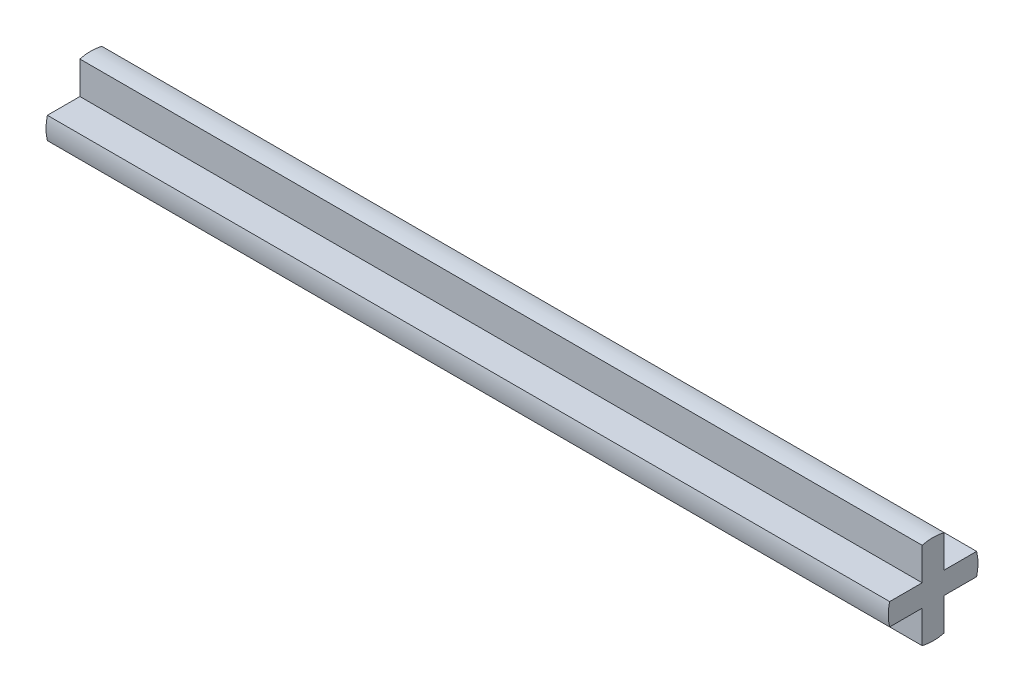
ISO-10303-21;
HEADER;
FILE_DESCRIPTION(('STEP AP214'),'2;1');
FILE_NAME('part.step','',(''),(''),'','','');
FILE_SCHEMA(('AUTOMOTIVE_DESIGN { 1 0 10303 214 1 1 1 1 }'));
ENDSEC;
DATA;
#1=APPLICATION_CONTEXT('core data for automotive mechanical design processes');
#2=APPLICATION_PROTOCOL_DEFINITION('international standard','automotive_design',2000,#1);
#3=PRODUCT_CONTEXT('',#1,'mechanical');
#4=PRODUCT('Part','Part','',(#3));
#5=PRODUCT_RELATED_PRODUCT_CATEGORY('part','',(#4));
#6=PRODUCT_DEFINITION_FORMATION('','',#4);
#7=PRODUCT_DEFINITION_CONTEXT('part definition',#1,'design');
#8=PRODUCT_DEFINITION('design','',#6,#7);
#9=PRODUCT_DEFINITION_SHAPE('','',#8);
#10=(LENGTH_UNIT() NAMED_UNIT(*) SI_UNIT(.MILLI.,.METRE.));
#11=(NAMED_UNIT(*) PLANE_ANGLE_UNIT() SI_UNIT($,.RADIAN.));
#12=(NAMED_UNIT(*) SI_UNIT($,.STERADIAN.) SOLID_ANGLE_UNIT());
#13=UNCERTAINTY_MEASURE_WITH_UNIT(LENGTH_MEASURE(1.E-05),#10,'distance_accuracy_value','');
#14=(GEOMETRIC_REPRESENTATION_CONTEXT(3) GLOBAL_UNCERTAINTY_ASSIGNED_CONTEXT((#13)) GLOBAL_UNIT_ASSIGNED_CONTEXT((#10,
#11,#12)) REPRESENTATION_CONTEXT('',''));
#15=CARTESIAN_POINT('',(0.,0.,0.));
#16=DIRECTION('',(0.,0.,1.));
#17=DIRECTION('',(1.,0.,0.));
#18=AXIS2_PLACEMENT_3D('',#15,#16,#17);
#19=CARTESIAN_POINT('',(23.,0.,0.));
#20=DIRECTION('',(-1.,0.,0.));
#21=DIRECTION('',(0.,0.,1.));
#22=AXIS2_PLACEMENT_3D('',#19,#20,#21);
#23=CYLINDRICAL_SURFACE('',#22,2.45);
#24=DIRECTION('',(-1.,0.,0.));
#25=VECTOR('',#24,1.);
#26=CARTESIAN_POINT('',(23.,0.6,2.37539470404394));
#27=LINE('',#26,#25);
#28=CARTESIAN_POINT('',(-23.,0.6,2.37539470404394));
#29=VERTEX_POINT('',#28);
#30=CARTESIAN_POINT('',(23.,0.6,2.37539470404394));
#31=VERTEX_POINT('',#30);
#32=EDGE_CURVE('E191',#29,#31,#27,.F.);
#33=ORIENTED_EDGE('',*,*,#32,.F.);
#34=CARTESIAN_POINT('',(-23.,0.,0.));
#35=DIRECTION('',(1.,0.,0.));
#36=DIRECTION('',(0.,0.,-1.));
#37=AXIS2_PLACEMENT_3D('',#34,#35,#36);
#38=CIRCLE('',#37,2.45);
#39=CARTESIAN_POINT('',(-23.,-0.6,2.37539470404394));
#40=VERTEX_POINT('',#39);
#41=EDGE_CURVE('E215',#29,#40,#38,.T.);
#42=ORIENTED_EDGE('',*,*,#41,.T.);
#43=DIRECTION('',(-1.,0.,0.));
#44=VECTOR('',#43,1.);
#45=CARTESIAN_POINT('',(23.,-0.6,2.37539470404394));
#46=LINE('',#45,#44);
#47=CARTESIAN_POINT('',(23.,-0.6,2.37539470404394));
#48=VERTEX_POINT('',#47);
#49=EDGE_CURVE('E57',#48,#40,#46,.T.);
#50=ORIENTED_EDGE('',*,*,#49,.F.);
#51=CARTESIAN_POINT('',(23.,0.,0.));
#52=DIRECTION('',(1.,0.,0.));
#53=DIRECTION('',(0.,0.,-1.));
#54=AXIS2_PLACEMENT_3D('',#51,#52,#53);
#55=CIRCLE('',#54,2.45);
#56=EDGE_CURVE('E234',#31,#48,#55,.T.);
#57=ORIENTED_EDGE('',*,*,#56,.F.);
#58=EDGE_LOOP('',(#33,#42,#50,#57));
#59=FACE_BOUND('',#58,.T.);
#60=ADVANCED_FACE('F35',(#59),#23,.T.);
#61=DIRECTION('',(-1.,0.,0.));
#62=VECTOR('',#61,1.);
#63=CARTESIAN_POINT('',(23.,2.37539470404394,0.6));
#64=LINE('',#63,#62);
#65=CARTESIAN_POINT('',(23.,2.37539470404394,0.6));
#66=VERTEX_POINT('',#65);
#67=CARTESIAN_POINT('',(-23.,2.37539470404394,0.6));
#68=VERTEX_POINT('',#67);
#69=EDGE_CURVE('E189',#66,#68,#64,.T.);
#70=ORIENTED_EDGE('',*,*,#69,.F.);
#71=CARTESIAN_POINT('',(23.,2.37539470404394,-0.600000000000001));
#72=VERTEX_POINT('',#71);
#73=EDGE_CURVE('E198',#72,#66,#55,.T.);
#74=ORIENTED_EDGE('',*,*,#73,.F.);
#75=DIRECTION('',(-1.,0.,0.));
#76=VECTOR('',#75,1.);
#77=CARTESIAN_POINT('',(23.,2.37539470404394,-0.600000000000001));
#78=LINE('',#77,#76);
#79=CARTESIAN_POINT('',(-23.,2.37539470404394,-0.600000000000001));
#80=VERTEX_POINT('',#79);
#81=EDGE_CURVE('E187',#80,#72,#78,.F.);
#82=ORIENTED_EDGE('',*,*,#81,.F.);
#83=EDGE_CURVE('E197',#80,#68,#38,.T.);
#84=ORIENTED_EDGE('',*,*,#83,.T.);
#85=EDGE_LOOP('',(#70,#74,#82,#84));
#86=FACE_BOUND('',#85,.T.);
#87=ADVANCED_FACE('F242',(#86),#23,.T.);
#88=DIRECTION('',(-1.,0.,0.));
#89=VECTOR('',#88,1.);
#90=CARTESIAN_POINT('',(23.,0.6,-2.37539470404394));
#91=LINE('',#90,#89);
#92=CARTESIAN_POINT('',(23.,0.6,-2.37539470404394));
#93=VERTEX_POINT('',#92);
#94=CARTESIAN_POINT('',(-23.,0.6,-2.37539470404394));
#95=VERTEX_POINT('',#94);
#96=EDGE_CURVE('E185',#93,#95,#91,.T.);
#97=ORIENTED_EDGE('',*,*,#96,.F.);
#98=CARTESIAN_POINT('',(23.,-0.600000000000001,-2.37539470404394));
#99=VERTEX_POINT('',#98);
#100=EDGE_CURVE('E193',#99,#93,#55,.T.);
#101=ORIENTED_EDGE('',*,*,#100,.F.);
#102=DIRECTION('',(-1.,0.,0.));
#103=VECTOR('',#102,1.);
#104=CARTESIAN_POINT('',(23.,-0.600000000000001,-2.37539470404394));
#105=LINE('',#104,#103);
#106=CARTESIAN_POINT('',(-23.,-0.600000000000001,-2.37539470404394));
#107=VERTEX_POINT('',#106);
#108=EDGE_CURVE('E183',#107,#99,#105,.F.);
#109=ORIENTED_EDGE('',*,*,#108,.F.);
#110=EDGE_CURVE('E145',#107,#95,#38,.T.);
#111=ORIENTED_EDGE('',*,*,#110,.T.);
#112=EDGE_LOOP('',(#97,#101,#109,#111));
#113=FACE_BOUND('',#112,.T.);
#114=ADVANCED_FACE('F240',(#113),#23,.T.);
#115=DIRECTION('',(-1.,0.,0.));
#116=VECTOR('',#115,1.);
#117=CARTESIAN_POINT('',(23.,-2.37539470404394,-0.600000000000001));
#118=LINE('',#117,#116);
#119=CARTESIAN_POINT('',(23.,-2.37539470404394,-0.600000000000001));
#120=VERTEX_POINT('',#119);
#121=CARTESIAN_POINT('',(-23.,-2.37539470404394,-0.600000000000001));
#122=VERTEX_POINT('',#121);
#123=EDGE_CURVE('E49',#120,#122,#118,.T.);
#124=ORIENTED_EDGE('',*,*,#123,.F.);
#125=CARTESIAN_POINT('',(23.,-2.37539470404394,0.599999999999998));
#126=VERTEX_POINT('',#125);
#127=EDGE_CURVE('E196',#126,#120,#55,.T.);
#128=ORIENTED_EDGE('',*,*,#127,.F.);
#129=DIRECTION('',(-1.,0.,0.));
#130=VECTOR('',#129,1.);
#131=CARTESIAN_POINT('',(23.,-2.37539470404394,0.599999999999998));
#132=LINE('',#131,#130);
#133=CARTESIAN_POINT('',(-23.,-2.37539470404394,0.599999999999998));
#134=VERTEX_POINT('',#133);
#135=EDGE_CURVE('E180',#134,#126,#132,.F.);
#136=ORIENTED_EDGE('',*,*,#135,.F.);
#137=EDGE_CURVE('E200',#134,#122,#38,.T.);
#138=ORIENTED_EDGE('',*,*,#137,.T.);
#139=EDGE_LOOP('',(#124,#128,#136,#138));
#140=FACE_BOUND('',#139,.T.);
#141=ADVANCED_FACE('F222',(#140),#23,.T.);
#142=CARTESIAN_POINT('',(23.,0.,0.));
#143=DIRECTION('',(1.,0.,0.));
#144=DIRECTION('',(0.,0.,-1.));
#145=AXIS2_PLACEMENT_3D('',#142,#143,#144);
#146=PLANE('',#145);
#147=DIRECTION('',(0.,-1.,0.));
#148=VECTOR('',#147,1.);
#149=CARTESIAN_POINT('',(23.,0.6,0.6));
#150=LINE('',#149,#148);
#151=CARTESIAN_POINT('',(23.,0.6,0.6));
#152=VERTEX_POINT('',#151);
#153=EDGE_CURVE('E170',#66,#152,#150,.T.);
#154=ORIENTED_EDGE('',*,*,#153,.T.);
#155=DIRECTION('',(0.,0.,1.));
#156=VECTOR('',#155,1.);
#157=CARTESIAN_POINT('',(23.,0.6,3.));
#158=LINE('',#157,#156);
#159=EDGE_CURVE('E151',#152,#31,#158,.T.);
#160=ORIENTED_EDGE('',*,*,#159,.T.);
#161=ORIENTED_EDGE('',*,*,#56,.T.);
#162=DIRECTION('',(0.,0.,-1.));
#163=VECTOR('',#162,1.);
#164=CARTESIAN_POINT('',(23.,-0.6,0.599999999999998));
#165=LINE('',#164,#163);
#166=CARTESIAN_POINT('',(23.,-0.6,0.599999999999998));
#167=VERTEX_POINT('',#166);
#168=EDGE_CURVE('E155',#48,#167,#165,.T.);
#169=ORIENTED_EDGE('',*,*,#168,.T.);
#170=DIRECTION('',(0.,-1.,0.));
#171=VECTOR('',#170,1.);
#172=CARTESIAN_POINT('',(23.,-0.6,0.599999999999998));
#173=LINE('',#172,#171);
#174=EDGE_CURVE('E158',#167,#126,#173,.T.);
#175=ORIENTED_EDGE('',*,*,#174,.T.);
#176=ORIENTED_EDGE('',*,*,#127,.T.);
#177=DIRECTION('',(0.,1.,0.));
#178=VECTOR('',#177,1.);
#179=CARTESIAN_POINT('',(23.,-0.600000000000001,-0.600000000000001));
#180=LINE('',#179,#178);
#181=CARTESIAN_POINT('',(23.,-0.600000000000001,-0.600000000000001));
#182=VERTEX_POINT('',#181);
#183=EDGE_CURVE('E161',#120,#182,#180,.T.);
#184=ORIENTED_EDGE('',*,*,#183,.T.);
#185=DIRECTION('',(0.,0.,-1.));
#186=VECTOR('',#185,1.);
#187=CARTESIAN_POINT('',(23.,-0.600000000000001,-0.600000000000001));
#188=LINE('',#187,#186);
#189=EDGE_CURVE('E135',#182,#99,#188,.T.);
#190=ORIENTED_EDGE('',*,*,#189,.T.);
#191=ORIENTED_EDGE('',*,*,#100,.T.);
#192=DIRECTION('',(0.,0.,1.));
#193=VECTOR('',#192,1.);
#194=CARTESIAN_POINT('',(23.,0.6,-0.600000000000001));
#195=LINE('',#194,#193);
#196=CARTESIAN_POINT('',(23.,0.6,-0.600000000000001));
#197=VERTEX_POINT('',#196);
#198=EDGE_CURVE('E164',#93,#197,#195,.T.);
#199=ORIENTED_EDGE('',*,*,#198,.T.);
#200=DIRECTION('',(0.,1.,0.));
#201=VECTOR('',#200,1.);
#202=CARTESIAN_POINT('',(23.,0.6,-0.600000000000001));
#203=LINE('',#202,#201);
#204=EDGE_CURVE('E167',#197,#72,#203,.T.);
#205=ORIENTED_EDGE('',*,*,#204,.T.);
#206=ORIENTED_EDGE('',*,*,#73,.T.);
#207=EDGE_LOOP('',(#154,#160,#161,#169,#175,#176,#184,#190,#191,#199,#205,#206));
#208=FACE_BOUND('',#207,.T.);
#209=ADVANCED_FACE('F235',(#208),#146,.T.);
#210=CARTESIAN_POINT('',(-23.,0.,0.));
#211=DIRECTION('',(1.,0.,0.));
#212=DIRECTION('',(0.,0.,-1.));
#213=AXIS2_PLACEMENT_3D('',#210,#211,#212);
#214=PLANE('',#213);
#215=DIRECTION('',(0.,0.,1.));
#216=VECTOR('',#215,1.);
#217=CARTESIAN_POINT('',(-23.,0.6,3.));
#218=LINE('',#217,#216);
#219=CARTESIAN_POINT('',(-23.,0.6,0.6));
#220=VERTEX_POINT('',#219);
#221=EDGE_CURVE('E149',#220,#29,#218,.T.);
#222=ORIENTED_EDGE('',*,*,#221,.F.);
#223=DIRECTION('',(0.,-1.,0.));
#224=VECTOR('',#223,1.);
#225=CARTESIAN_POINT('',(-23.,0.,0.6));
#226=LINE('',#225,#224);
#227=EDGE_CURVE('E12',#68,#220,#226,.T.);
#228=ORIENTED_EDGE('',*,*,#227,.F.);
#229=ORIENTED_EDGE('',*,*,#83,.F.);
#230=DIRECTION('',(0.,1.,0.));
#231=VECTOR('',#230,1.);
#232=CARTESIAN_POINT('',(-23.,0.6,-0.600000000000001));
#233=LINE('',#232,#231);
#234=CARTESIAN_POINT('',(-23.,0.6,-0.600000000000001));
#235=VERTEX_POINT('',#234);
#236=EDGE_CURVE('E146',#235,#80,#233,.T.);
#237=ORIENTED_EDGE('',*,*,#236,.F.);
#238=DIRECTION('',(0.,0.,1.));
#239=VECTOR('',#238,1.);
#240=CARTESIAN_POINT('',(-23.,0.6,0.));
#241=LINE('',#240,#239);
#242=EDGE_CURVE('E42',#95,#235,#241,.T.);
#243=ORIENTED_EDGE('',*,*,#242,.F.);
#244=ORIENTED_EDGE('',*,*,#110,.F.);
#245=DIRECTION('',(0.,0.,-1.));
#246=VECTOR('',#245,1.);
#247=CARTESIAN_POINT('',(-23.,-0.600000000000001,-0.600000000000001));
#248=LINE('',#247,#246);
#249=CARTESIAN_POINT('',(-23.,-0.600000000000001,-0.600000000000001));
#250=VERTEX_POINT('',#249);
#251=EDGE_CURVE('E132',#250,#107,#248,.T.);
#252=ORIENTED_EDGE('',*,*,#251,.F.);
#253=DIRECTION('',(0.,1.,0.));
#254=VECTOR('',#253,1.);
#255=CARTESIAN_POINT('',(-23.,0.,-0.600000000000001));
#256=LINE('',#255,#254);
#257=EDGE_CURVE('E119',#122,#250,#256,.T.);
#258=ORIENTED_EDGE('',*,*,#257,.F.);
#259=ORIENTED_EDGE('',*,*,#137,.F.);
#260=DIRECTION('',(0.,-1.,0.));
#261=VECTOR('',#260,1.);
#262=CARTESIAN_POINT('',(-23.,-0.6,0.599999999999998));
#263=LINE('',#262,#261);
#264=CARTESIAN_POINT('',(-23.,-0.6,0.599999999999998));
#265=VERTEX_POINT('',#264);
#266=EDGE_CURVE('E147',#265,#134,#263,.T.);
#267=ORIENTED_EDGE('',*,*,#266,.F.);
#268=DIRECTION('',(0.,0.,-1.));
#269=VECTOR('',#268,1.);
#270=CARTESIAN_POINT('',(-23.,-0.6,0.));
#271=LINE('',#270,#269);
#272=EDGE_CURVE('E128',#40,#265,#271,.T.);
#273=ORIENTED_EDGE('',*,*,#272,.F.);
#274=ORIENTED_EDGE('',*,*,#41,.F.);
#275=EDGE_LOOP('',(#222,#228,#229,#237,#243,#244,#252,#258,#259,#267,#273,#274));
#276=FACE_BOUND('',#275,.T.);
#277=ADVANCED_FACE('F142',(#276),#214,.F.);
#278=CARTESIAN_POINT('',(-23.,-0.6,0.599999999999998));
#279=DIRECTION('',(0.,-1.,0.));
#280=DIRECTION('',(0.,0.,-1.));
#281=AXIS2_PLACEMENT_3D('',#278,#279,#280);
#282=PLANE('',#281);
#283=ORIENTED_EDGE('',*,*,#49,.T.);
#284=ORIENTED_EDGE('',*,*,#272,.T.);
#285=DIRECTION('',(1.,0.,0.));
#286=VECTOR('',#285,1.);
#287=CARTESIAN_POINT('',(-23.,-0.6,0.599999999999998));
#288=LINE('',#287,#286);
#289=EDGE_CURVE('E138',#265,#167,#288,.T.);
#290=ORIENTED_EDGE('',*,*,#289,.T.);
#291=ORIENTED_EDGE('',*,*,#168,.F.);
#292=EDGE_LOOP('',(#283,#284,#290,#291));
#293=FACE_BOUND('',#292,.T.);
#294=ADVANCED_FACE('F230',(#293),#282,.T.);
#295=CARTESIAN_POINT('',(-23.,-0.6,0.599999999999998));
#296=DIRECTION('',(0.,0.,1.));
#297=DIRECTION('',(0.,-1.,0.));
#298=AXIS2_PLACEMENT_3D('',#295,#296,#297);
#299=PLANE('',#298);
#300=ORIENTED_EDGE('',*,*,#135,.T.);
#301=ORIENTED_EDGE('',*,*,#174,.F.);
#302=ORIENTED_EDGE('',*,*,#289,.F.);
#303=ORIENTED_EDGE('',*,*,#266,.T.);
#304=EDGE_LOOP('',(#300,#301,#302,#303));
#305=FACE_BOUND('',#304,.T.);
#306=ADVANCED_FACE('F228',(#305),#299,.T.);
#307=CARTESIAN_POINT('',(-23.,-0.600000000000001,-0.600000000000001));
#308=DIRECTION('',(0.,0.,-1.));
#309=DIRECTION('',(0.,1.,0.));
#310=AXIS2_PLACEMENT_3D('',#307,#308,#309);
#311=PLANE('',#310);
#312=ORIENTED_EDGE('',*,*,#123,.T.);
#313=ORIENTED_EDGE('',*,*,#257,.T.);
#314=DIRECTION('',(1.,0.,0.));
#315=VECTOR('',#314,1.);
#316=CARTESIAN_POINT('',(-23.,-0.600000000000001,-0.600000000000001));
#317=LINE('',#316,#315);
#318=EDGE_CURVE('E122',#250,#182,#317,.T.);
#319=ORIENTED_EDGE('',*,*,#318,.T.);
#320=ORIENTED_EDGE('',*,*,#183,.F.);
#321=EDGE_LOOP('',(#312,#313,#319,#320));
#322=FACE_BOUND('',#321,.T.);
#323=ADVANCED_FACE('F121',(#322),#311,.T.);
#324=CARTESIAN_POINT('',(-23.,-0.600000000000001,-0.600000000000001));
#325=DIRECTION('',(0.,-1.,0.));
#326=DIRECTION('',(0.,0.,-1.));
#327=AXIS2_PLACEMENT_3D('',#324,#325,#326);
#328=PLANE('',#327);
#329=ORIENTED_EDGE('',*,*,#108,.T.);
#330=ORIENTED_EDGE('',*,*,#189,.F.);
#331=ORIENTED_EDGE('',*,*,#318,.F.);
#332=ORIENTED_EDGE('',*,*,#251,.T.);
#333=EDGE_LOOP('',(#329,#330,#331,#332));
#334=FACE_BOUND('',#333,.T.);
#335=ADVANCED_FACE('F131',(#334),#328,.T.);
#336=CARTESIAN_POINT('',(-23.,0.6,-0.600000000000001));
#337=DIRECTION('',(0.,1.,0.));
#338=DIRECTION('',(0.,0.,1.));
#339=AXIS2_PLACEMENT_3D('',#336,#337,#338);
#340=PLANE('',#339);
#341=ORIENTED_EDGE('',*,*,#96,.T.);
#342=ORIENTED_EDGE('',*,*,#242,.T.);
#343=DIRECTION('',(1.,0.,0.));
#344=VECTOR('',#343,1.);
#345=CARTESIAN_POINT('',(-23.,0.6,-0.600000000000001));
#346=LINE('',#345,#344);
#347=EDGE_CURVE('E137',#235,#197,#346,.T.);
#348=ORIENTED_EDGE('',*,*,#347,.T.);
#349=ORIENTED_EDGE('',*,*,#198,.F.);
#350=EDGE_LOOP('',(#341,#342,#348,#349));
#351=FACE_BOUND('',#350,.T.);
#352=ADVANCED_FACE('F203',(#351),#340,.T.);
#353=CARTESIAN_POINT('',(-23.,0.6,-0.600000000000001));
#354=DIRECTION('',(0.,0.,-1.));
#355=DIRECTION('',(-1.,0.,0.));
#356=AXIS2_PLACEMENT_3D('',#353,#354,#355);
#357=PLANE('',#356);
#358=ORIENTED_EDGE('',*,*,#81,.T.);
#359=ORIENTED_EDGE('',*,*,#204,.F.);
#360=ORIENTED_EDGE('',*,*,#347,.F.);
#361=ORIENTED_EDGE('',*,*,#236,.T.);
#362=EDGE_LOOP('',(#358,#359,#360,#361));
#363=FACE_BOUND('',#362,.T.);
#364=ADVANCED_FACE('F208',(#363),#357,.T.);
#365=CARTESIAN_POINT('',(-23.,0.6,3.));
#366=DIRECTION('',(0.,1.,0.));
#367=DIRECTION('',(0.,0.,1.));
#368=AXIS2_PLACEMENT_3D('',#365,#366,#367);
#369=PLANE('',#368);
#370=ORIENTED_EDGE('',*,*,#32,.T.);
#371=ORIENTED_EDGE('',*,*,#159,.F.);
#372=DIRECTION('',(1.,0.,0.));
#373=VECTOR('',#372,1.);
#374=CARTESIAN_POINT('',(-23.,0.6,0.6));
#375=LINE('',#374,#373);
#376=EDGE_CURVE('E175',#220,#152,#375,.T.);
#377=ORIENTED_EDGE('',*,*,#376,.F.);
#378=ORIENTED_EDGE('',*,*,#221,.T.);
#379=EDGE_LOOP('',(#370,#371,#377,#378));
#380=FACE_BOUND('',#379,.T.);
#381=ADVANCED_FACE('F328',(#380),#369,.T.);
#382=CARTESIAN_POINT('',(-23.,0.6,0.6));
#383=DIRECTION('',(0.,0.,1.));
#384=DIRECTION('',(1.,0.,0.));
#385=AXIS2_PLACEMENT_3D('',#382,#383,#384);
#386=PLANE('',#385);
#387=ORIENTED_EDGE('',*,*,#69,.T.);
#388=ORIENTED_EDGE('',*,*,#227,.T.);
#389=ORIENTED_EDGE('',*,*,#376,.T.);
#390=ORIENTED_EDGE('',*,*,#153,.F.);
#391=EDGE_LOOP('',(#387,#388,#389,#390));
#392=FACE_BOUND('',#391,.T.);
#393=ADVANCED_FACE('F337',(#392),#386,.T.);
#394=CLOSED_SHELL('',(#60,#87,#114,#141,#209,#277,#294,#306,#323,#335,#352,#364,#381,#393));
#395=MANIFOLD_SOLID_BREP('B2',#394);
#396=ADVANCED_BREP_SHAPE_REPRESENTATION('',(#18,#395),#14);
#397=SHAPE_DEFINITION_REPRESENTATION(#9,#396);
ENDSEC;
END-ISO-10303-21;
